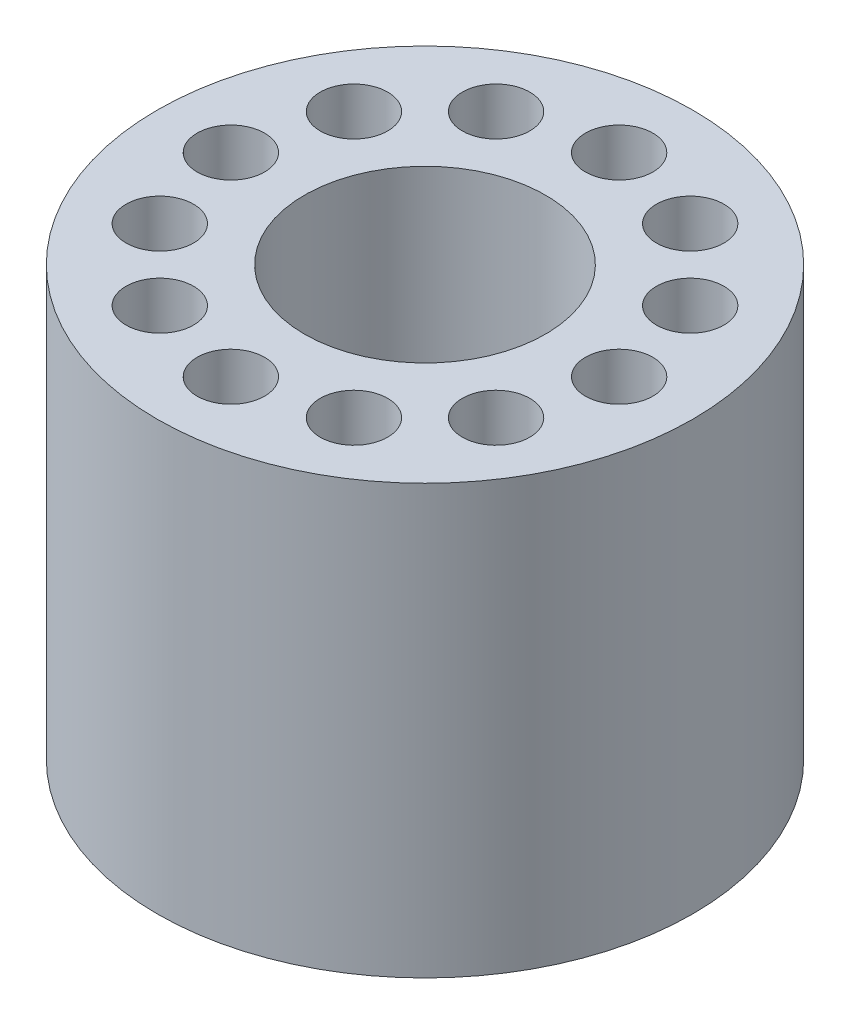
ISO-10303-21;
HEADER;
FILE_DESCRIPTION(('STEP AP214'),'2;1');
FILE_NAME('part.step','',(''),(''),'','','');
FILE_SCHEMA(('AUTOMOTIVE_DESIGN { 1 0 10303 214 1 1 1 1 }'));
ENDSEC;
DATA;
#1=APPLICATION_CONTEXT('core data for automotive mechanical design processes');
#2=APPLICATION_PROTOCOL_DEFINITION('international standard','automotive_design',2000,#1);
#3=PRODUCT_CONTEXT('',#1,'mechanical');
#4=PRODUCT('Part','Part','',(#3));
#5=PRODUCT_RELATED_PRODUCT_CATEGORY('part','',(#4));
#6=PRODUCT_DEFINITION_FORMATION('','',#4);
#7=PRODUCT_DEFINITION_CONTEXT('part definition',#1,'design');
#8=PRODUCT_DEFINITION('design','',#6,#7);
#9=PRODUCT_DEFINITION_SHAPE('','',#8);
#10=(LENGTH_UNIT() NAMED_UNIT(*) SI_UNIT(.MILLI.,.METRE.));
#11=(NAMED_UNIT(*) PLANE_ANGLE_UNIT() SI_UNIT($,.RADIAN.));
#12=(NAMED_UNIT(*) SI_UNIT($,.STERADIAN.) SOLID_ANGLE_UNIT());
#13=UNCERTAINTY_MEASURE_WITH_UNIT(LENGTH_MEASURE(1.E-05),#10,'distance_accuracy_value','');
#14=(GEOMETRIC_REPRESENTATION_CONTEXT(3) GLOBAL_UNCERTAINTY_ASSIGNED_CONTEXT((#13)) GLOBAL_UNIT_ASSIGNED_CONTEXT((#10,
#11,#12)) REPRESENTATION_CONTEXT('',''));
#15=CARTESIAN_POINT('',(0.,0.,0.));
#16=DIRECTION('',(0.,0.,1.));
#17=DIRECTION('',(1.,0.,0.));
#18=AXIS2_PLACEMENT_3D('',#15,#16,#17);
#19=CARTESIAN_POINT('',(0.,25.4,0.));
#20=DIRECTION('',(0.,1.,0.));
#21=DIRECTION('',(0.,0.,1.));
#22=AXIS2_PLACEMENT_3D('',#19,#20,#21);
#23=PLANE('',#22);
#24=CARTESIAN_POINT('',(-9.96741113168158,25.4,5.75468749999991));
#25=DIRECTION('',(0.,1.,0.));
#26=DIRECTION('',(0.,0.,1.));
#27=AXIS2_PLACEMENT_3D('',#24,#25,#26);
#28=CIRCLE('',#27,2.);
#29=CARTESIAN_POINT('',(-9.96741113168158,25.4,7.75468749999991));
#30=VERTEX_POINT('',#29);
#31=EDGE_CURVE('E93',#30,#30,#28,.T.);
#32=ORIENTED_EDGE('',*,*,#31,.F.);
#33=EDGE_LOOP('',(#32));
#34=FACE_BOUND('',#33,.T.);
#35=CARTESIAN_POINT('',(-5.75468750000008,25.4,9.96741113168147));
#36=DIRECTION('',(0.,1.,0.));
#37=DIRECTION('',(0.,0.,1.));
#38=AXIS2_PLACEMENT_3D('',#35,#36,#37);
#39=CIRCLE('',#38,2.);
#40=CARTESIAN_POINT('',(-5.75468750000008,25.4,11.9674111316815));
#41=VERTEX_POINT('',#40);
#42=EDGE_CURVE('E100',#41,#41,#39,.T.);
#43=ORIENTED_EDGE('',*,*,#42,.F.);
#44=EDGE_LOOP('',(#43));
#45=FACE_BOUND('',#44,.T.);
#46=CARTESIAN_POINT('',(0.,25.4,11.509375));
#47=DIRECTION('',(0.,1.,0.));
#48=DIRECTION('',(0.,0.,1.));
#49=AXIS2_PLACEMENT_3D('',#46,#47,#48);
#50=CIRCLE('',#49,2.);
#51=CARTESIAN_POINT('',(0.,25.4,13.509375));
#52=VERTEX_POINT('',#51);
#53=EDGE_CURVE('E106',#52,#52,#50,.T.);
#54=ORIENTED_EDGE('',*,*,#53,.F.);
#55=EDGE_LOOP('',(#54));
#56=FACE_BOUND('',#55,.T.);
#57=CARTESIAN_POINT('',(5.75468749999995,25.4,9.96741113168156));
#58=DIRECTION('',(0.,1.,0.));
#59=DIRECTION('',(0.,0.,1.));
#60=AXIS2_PLACEMENT_3D('',#57,#58,#59);
#61=CIRCLE('',#60,2.);
#62=CARTESIAN_POINT('',(5.75468749999995,25.4,11.9674111316816));
#63=VERTEX_POINT('',#62);
#64=EDGE_CURVE('E70',#63,#63,#61,.T.);
#65=ORIENTED_EDGE('',*,*,#64,.F.);
#66=EDGE_LOOP('',(#65));
#67=FACE_BOUND('',#66,.T.);
#68=CARTESIAN_POINT('',(9.9674111316815,25.4,5.75468750000005));
#69=DIRECTION('',(0.,1.,0.));
#70=DIRECTION('',(0.,0.,1.));
#71=AXIS2_PLACEMENT_3D('',#68,#69,#70);
#72=CIRCLE('',#71,2.);
#73=CARTESIAN_POINT('',(9.9674111316815,25.4,7.75468750000005));
#74=VERTEX_POINT('',#73);
#75=EDGE_CURVE('E69',#74,#74,#72,.T.);
#76=ORIENTED_EDGE('',*,*,#75,.F.);
#77=EDGE_LOOP('',(#76));
#78=FACE_BOUND('',#77,.T.);
#79=CARTESIAN_POINT('',(11.509375,25.4,0.));
#80=DIRECTION('',(0.,1.,0.));
#81=DIRECTION('',(0.,0.,1.));
#82=AXIS2_PLACEMENT_3D('',#79,#80,#81);
#83=CIRCLE('',#82,2.);
#84=CARTESIAN_POINT('',(11.509375,25.4,2.00000000000004));
#85=VERTEX_POINT('',#84);
#86=EDGE_CURVE('E76',#85,#85,#83,.T.);
#87=ORIENTED_EDGE('',*,*,#86,.F.);
#88=EDGE_LOOP('',(#87));
#89=FACE_BOUND('',#88,.T.);
#90=CARTESIAN_POINT('',(9.96741113168154,25.4,-5.75468749999998));
#91=DIRECTION('',(0.,1.,0.));
#92=DIRECTION('',(0.,0.,1.));
#93=AXIS2_PLACEMENT_3D('',#90,#91,#92);
#94=CIRCLE('',#93,2.);
#95=CARTESIAN_POINT('',(9.96741113168154,25.4,-3.75468749999998));
#96=VERTEX_POINT('',#95);
#97=EDGE_CURVE('E82',#96,#96,#94,.T.);
#98=ORIENTED_EDGE('',*,*,#97,.F.);
#99=EDGE_LOOP('',(#98));
#100=FACE_BOUND('',#99,.T.);
#101=CARTESIAN_POINT('',(5.75468750000001,25.4,-9.96741113168152));
#102=DIRECTION('',(0.,1.,0.));
#103=DIRECTION('',(0.,0.,1.));
#104=AXIS2_PLACEMENT_3D('',#101,#102,#103);
#105=CIRCLE('',#104,2.);
#106=CARTESIAN_POINT('',(5.75468750000001,25.4,-7.96741113168152));
#107=VERTEX_POINT('',#106);
#108=EDGE_CURVE('E63',#107,#107,#105,.T.);
#109=ORIENTED_EDGE('',*,*,#108,.F.);
#110=EDGE_LOOP('',(#109));
#111=FACE_BOUND('',#110,.T.);
#112=CARTESIAN_POINT('',(-11.509375,25.4,-1.20554304102743E-13));
#113=DIRECTION('',(0.,1.,0.));
#114=DIRECTION('',(0.,0.,1.));
#115=AXIS2_PLACEMENT_3D('',#112,#113,#114);
#116=CIRCLE('',#115,2.);
#117=CARTESIAN_POINT('',(-11.509375,25.4,1.99999999999988));
#118=VERTEX_POINT('',#117);
#119=EDGE_CURVE('E94',#118,#118,#116,.T.);
#120=ORIENTED_EDGE('',*,*,#119,.F.);
#121=EDGE_LOOP('',(#120));
#122=FACE_BOUND('',#121,.T.);
#123=CARTESIAN_POINT('',(-9.96741113168146,25.4,-5.75468750000012));
#124=DIRECTION('',(0.,1.,0.));
#125=DIRECTION('',(0.,0.,1.));
#126=AXIS2_PLACEMENT_3D('',#123,#124,#125);
#127=CIRCLE('',#126,2.);
#128=CARTESIAN_POINT('',(-9.96741113168146,25.4,-3.75468750000012));
#129=VERTEX_POINT('',#128);
#130=EDGE_CURVE('E123',#129,#129,#127,.T.);
#131=ORIENTED_EDGE('',*,*,#130,.F.);
#132=EDGE_LOOP('',(#131));
#133=FACE_BOUND('',#132,.T.);
#134=CARTESIAN_POINT('',(-5.75468749999987,25.4,-9.9674111316816));
#135=DIRECTION('',(0.,1.,0.));
#136=DIRECTION('',(0.,0.,1.));
#137=AXIS2_PLACEMENT_3D('',#134,#135,#136);
#138=CIRCLE('',#137,2.);
#139=CARTESIAN_POINT('',(-5.75468749999987,25.4,-7.9674111316816));
#140=VERTEX_POINT('',#139);
#141=EDGE_CURVE('E117',#140,#140,#138,.T.);
#142=ORIENTED_EDGE('',*,*,#141,.F.);
#143=EDGE_LOOP('',(#142));
#144=FACE_BOUND('',#143,.T.);
#145=CARTESIAN_POINT('',(0.,25.4,-11.509375));
#146=DIRECTION('',(0.,1.,0.));
#147=DIRECTION('',(0.,0.,1.));
#148=AXIS2_PLACEMENT_3D('',#145,#146,#147);
#149=CIRCLE('',#148,2.);
#150=CARTESIAN_POINT('',(0.,25.4,-9.509375));
#151=VERTEX_POINT('',#150);
#152=EDGE_CURVE('E60',#151,#151,#149,.T.);
#153=ORIENTED_EDGE('',*,*,#152,.F.);
#154=EDGE_LOOP('',(#153));
#155=FACE_BOUND('',#154,.T.);
#156=CARTESIAN_POINT('',(0.,25.4,0.));
#157=DIRECTION('',(0.,1.,0.));
#158=DIRECTION('',(0.,0.,1.));
#159=AXIS2_PLACEMENT_3D('',#156,#157,#158);
#160=CIRCLE('',#159,15.875);
#161=CARTESIAN_POINT('',(0.,25.4,15.875));
#162=VERTEX_POINT('',#161);
#163=EDGE_CURVE('E10',#162,#162,#160,.T.);
#164=ORIENTED_EDGE('',*,*,#163,.T.);
#165=EDGE_LOOP('',(#164));
#166=FACE_BOUND('',#165,.T.);
#167=CARTESIAN_POINT('',(0.,25.4,0.));
#168=DIRECTION('',(0.,1.,0.));
#169=DIRECTION('',(0.,0.,1.));
#170=AXIS2_PLACEMENT_3D('',#167,#168,#169);
#171=CIRCLE('',#170,7.14375);
#172=CARTESIAN_POINT('',(0.,25.4,7.14375));
#173=VERTEX_POINT('',#172);
#174=EDGE_CURVE('E52',#173,#173,#171,.T.);
#175=ORIENTED_EDGE('',*,*,#174,.F.);
#176=EDGE_LOOP('',(#175));
#177=FACE_BOUND('',#176,.T.);
#178=ADVANCED_FACE('F41',(#34,#45,#56,#67,#78,#89,#100,#111,#122,#133,#144,#155,#166,#177),#23,.T.);
#179=CARTESIAN_POINT('',(0.,0.,0.));
#180=DIRECTION('',(0.,1.,0.));
#181=DIRECTION('',(0.,0.,1.));
#182=AXIS2_PLACEMENT_3D('',#179,#180,#181);
#183=PLANE('',#182);
#184=CARTESIAN_POINT('',(-9.96741113168158,0.,5.75468749999991));
#185=DIRECTION('',(0.,1.,0.));
#186=DIRECTION('',(0.,0.,1.));
#187=AXIS2_PLACEMENT_3D('',#184,#185,#186);
#188=CIRCLE('',#187,2.);
#189=CARTESIAN_POINT('',(-9.96741113168158,0.,7.75468749999991));
#190=VERTEX_POINT('',#189);
#191=EDGE_CURVE('E90',#190,#190,#188,.T.);
#192=ORIENTED_EDGE('',*,*,#191,.T.);
#193=EDGE_LOOP('',(#192));
#194=FACE_BOUND('',#193,.T.);
#195=CARTESIAN_POINT('',(-5.75468750000008,0.,9.96741113168147));
#196=DIRECTION('',(0.,1.,0.));
#197=DIRECTION('',(0.,0.,1.));
#198=AXIS2_PLACEMENT_3D('',#195,#196,#197);
#199=CIRCLE('',#198,2.);
#200=CARTESIAN_POINT('',(-5.75468750000008,0.,11.9674111316815));
#201=VERTEX_POINT('',#200);
#202=EDGE_CURVE('E97',#201,#201,#199,.T.);
#203=ORIENTED_EDGE('',*,*,#202,.T.);
#204=EDGE_LOOP('',(#203));
#205=FACE_BOUND('',#204,.T.);
#206=CARTESIAN_POINT('',(0.,0.,11.509375));
#207=DIRECTION('',(0.,1.,0.));
#208=DIRECTION('',(0.,0.,1.));
#209=AXIS2_PLACEMENT_3D('',#206,#207,#208);
#210=CIRCLE('',#209,2.);
#211=CARTESIAN_POINT('',(0.,0.,13.509375));
#212=VERTEX_POINT('',#211);
#213=EDGE_CURVE('E103',#212,#212,#210,.T.);
#214=ORIENTED_EDGE('',*,*,#213,.T.);
#215=EDGE_LOOP('',(#214));
#216=FACE_BOUND('',#215,.T.);
#217=CARTESIAN_POINT('',(5.75468749999995,0.,9.96741113168156));
#218=DIRECTION('',(0.,1.,0.));
#219=DIRECTION('',(0.,0.,1.));
#220=AXIS2_PLACEMENT_3D('',#217,#218,#219);
#221=CIRCLE('',#220,2.);
#222=CARTESIAN_POINT('',(5.75468749999995,0.,11.9674111316816));
#223=VERTEX_POINT('',#222);
#224=EDGE_CURVE('E109',#223,#223,#221,.T.);
#225=ORIENTED_EDGE('',*,*,#224,.T.);
#226=EDGE_LOOP('',(#225));
#227=FACE_BOUND('',#226,.T.);
#228=CARTESIAN_POINT('',(9.9674111316815,0.,5.75468750000005));
#229=DIRECTION('',(0.,1.,0.));
#230=DIRECTION('',(0.,0.,1.));
#231=AXIS2_PLACEMENT_3D('',#228,#229,#230);
#232=CIRCLE('',#231,2.);
#233=CARTESIAN_POINT('',(9.9674111316815,0.,7.75468750000005));
#234=VERTEX_POINT('',#233);
#235=EDGE_CURVE('E66',#234,#234,#232,.T.);
#236=ORIENTED_EDGE('',*,*,#235,.T.);
#237=EDGE_LOOP('',(#236));
#238=FACE_BOUND('',#237,.T.);
#239=CARTESIAN_POINT('',(11.509375,0.,0.));
#240=DIRECTION('',(0.,1.,0.));
#241=DIRECTION('',(0.,0.,1.));
#242=AXIS2_PLACEMENT_3D('',#239,#240,#241);
#243=CIRCLE('',#242,2.);
#244=CARTESIAN_POINT('',(11.509375,0.,2.00000000000004));
#245=VERTEX_POINT('',#244);
#246=EDGE_CURVE('E73',#245,#245,#243,.T.);
#247=ORIENTED_EDGE('',*,*,#246,.T.);
#248=EDGE_LOOP('',(#247));
#249=FACE_BOUND('',#248,.T.);
#250=CARTESIAN_POINT('',(9.96741113168154,0.,-5.75468749999998));
#251=DIRECTION('',(0.,1.,0.));
#252=DIRECTION('',(0.,0.,1.));
#253=AXIS2_PLACEMENT_3D('',#250,#251,#252);
#254=CIRCLE('',#253,2.);
#255=CARTESIAN_POINT('',(9.96741113168154,0.,-3.75468749999998));
#256=VERTEX_POINT('',#255);
#257=EDGE_CURVE('E79',#256,#256,#254,.T.);
#258=ORIENTED_EDGE('',*,*,#257,.T.);
#259=EDGE_LOOP('',(#258));
#260=FACE_BOUND('',#259,.T.);
#261=CARTESIAN_POINT('',(5.75468750000001,0.,-9.96741113168152));
#262=DIRECTION('',(0.,1.,0.));
#263=DIRECTION('',(0.,0.,1.));
#264=AXIS2_PLACEMENT_3D('',#261,#262,#263);
#265=CIRCLE('',#264,2.);
#266=CARTESIAN_POINT('',(5.75468750000001,0.,-7.96741113168152));
#267=VERTEX_POINT('',#266);
#268=EDGE_CURVE('E85',#267,#267,#265,.T.);
#269=ORIENTED_EDGE('',*,*,#268,.T.);
#270=EDGE_LOOP('',(#269));
#271=FACE_BOUND('',#270,.T.);
#272=CARTESIAN_POINT('',(-11.509375,0.,-1.20554304102743E-13));
#273=DIRECTION('',(0.,1.,0.));
#274=DIRECTION('',(0.,0.,1.));
#275=AXIS2_PLACEMENT_3D('',#272,#273,#274);
#276=CIRCLE('',#275,2.);
#277=CARTESIAN_POINT('',(-11.509375,0.,1.99999999999988));
#278=VERTEX_POINT('',#277);
#279=EDGE_CURVE('E126',#278,#278,#276,.T.);
#280=ORIENTED_EDGE('',*,*,#279,.T.);
#281=EDGE_LOOP('',(#280));
#282=FACE_BOUND('',#281,.T.);
#283=CARTESIAN_POINT('',(-9.96741113168146,0.,-5.75468750000012));
#284=DIRECTION('',(0.,1.,0.));
#285=DIRECTION('',(0.,0.,1.));
#286=AXIS2_PLACEMENT_3D('',#283,#284,#285);
#287=CIRCLE('',#286,2.);
#288=CARTESIAN_POINT('',(-9.96741113168146,0.,-3.75468750000012));
#289=VERTEX_POINT('',#288);
#290=EDGE_CURVE('E120',#289,#289,#287,.T.);
#291=ORIENTED_EDGE('',*,*,#290,.T.);
#292=EDGE_LOOP('',(#291));
#293=FACE_BOUND('',#292,.T.);
#294=CARTESIAN_POINT('',(-5.75468749999987,0.,-9.9674111316816));
#295=DIRECTION('',(0.,1.,0.));
#296=DIRECTION('',(0.,0.,1.));
#297=AXIS2_PLACEMENT_3D('',#294,#295,#296);
#298=CIRCLE('',#297,2.);
#299=CARTESIAN_POINT('',(-5.75468749999987,0.,-7.9674111316816));
#300=VERTEX_POINT('',#299);
#301=EDGE_CURVE('E114',#300,#300,#298,.T.);
#302=ORIENTED_EDGE('',*,*,#301,.T.);
#303=EDGE_LOOP('',(#302));
#304=FACE_BOUND('',#303,.T.);
#305=CARTESIAN_POINT('',(0.,0.,-11.509375));
#306=DIRECTION('',(0.,1.,0.));
#307=DIRECTION('',(0.,0.,1.));
#308=AXIS2_PLACEMENT_3D('',#305,#306,#307);
#309=CIRCLE('',#308,2.);
#310=CARTESIAN_POINT('',(0.,0.,-9.509375));
#311=VERTEX_POINT('',#310);
#312=EDGE_CURVE('E57',#311,#311,#309,.T.);
#313=ORIENTED_EDGE('',*,*,#312,.T.);
#314=EDGE_LOOP('',(#313));
#315=FACE_BOUND('',#314,.T.);
#316=CARTESIAN_POINT('',(0.,0.,0.));
#317=DIRECTION('',(0.,1.,0.));
#318=DIRECTION('',(0.,0.,1.));
#319=AXIS2_PLACEMENT_3D('',#316,#317,#318);
#320=CIRCLE('',#319,15.875);
#321=CARTESIAN_POINT('',(0.,0.,15.875));
#322=VERTEX_POINT('',#321);
#323=EDGE_CURVE('E45',#322,#322,#320,.T.);
#324=ORIENTED_EDGE('',*,*,#323,.F.);
#325=EDGE_LOOP('',(#324));
#326=FACE_BOUND('',#325,.T.);
#327=CARTESIAN_POINT('',(0.,0.,0.));
#328=DIRECTION('',(0.,1.,0.));
#329=DIRECTION('',(0.,0.,1.));
#330=AXIS2_PLACEMENT_3D('',#327,#328,#329);
#331=CIRCLE('',#330,7.14375);
#332=CARTESIAN_POINT('',(0.,0.,7.14375));
#333=VERTEX_POINT('',#332);
#334=EDGE_CURVE('E54',#333,#333,#331,.T.);
#335=ORIENTED_EDGE('',*,*,#334,.T.);
#336=EDGE_LOOP('',(#335));
#337=FACE_BOUND('',#336,.T.);
#338=ADVANCED_FACE('F136',(#194,#205,#216,#227,#238,#249,#260,#271,#282,#293,#304,#315,#326,
#337),#183,.F.);
#339=CARTESIAN_POINT('',(0.,25.4,0.));
#340=DIRECTION('',(0.,-1.,0.));
#341=DIRECTION('',(0.,0.,-1.));
#342=AXIS2_PLACEMENT_3D('',#339,#340,#341);
#343=CYLINDRICAL_SURFACE('',#342,15.875);
#344=ORIENTED_EDGE('',*,*,#163,.F.);
#345=EDGE_LOOP('',(#344));
#346=FACE_BOUND('',#345,.T.);
#347=ORIENTED_EDGE('',*,*,#323,.T.);
#348=EDGE_LOOP('',(#347));
#349=FACE_BOUND('',#348,.T.);
#350=ADVANCED_FACE('F43',(#346,#349),#343,.T.);
#351=CARTESIAN_POINT('',(0.,25.4,0.));
#352=DIRECTION('',(0.,-1.,0.));
#353=DIRECTION('',(0.,0.,-1.));
#354=AXIS2_PLACEMENT_3D('',#351,#352,#353);
#355=CYLINDRICAL_SURFACE('',#354,7.14375);
#356=ORIENTED_EDGE('',*,*,#174,.T.);
#357=EDGE_LOOP('',(#356));
#358=FACE_BOUND('',#357,.T.);
#359=ORIENTED_EDGE('',*,*,#334,.F.);
#360=EDGE_LOOP('',(#359));
#361=FACE_BOUND('',#360,.T.);
#362=ADVANCED_FACE('F147',(#358,#361),#355,.F.);
#363=CARTESIAN_POINT('',(0.,0.,-11.509375));
#364=DIRECTION('',(0.,1.,0.));
#365=DIRECTION('',(0.,0.,1.));
#366=AXIS2_PLACEMENT_3D('',#363,#364,#365);
#367=CYLINDRICAL_SURFACE('',#366,2.);
#368=ORIENTED_EDGE('',*,*,#312,.F.);
#369=EDGE_LOOP('',(#368));
#370=FACE_BOUND('',#369,.T.);
#371=ORIENTED_EDGE('',*,*,#152,.T.);
#372=EDGE_LOOP('',(#371));
#373=FACE_BOUND('',#372,.T.);
#374=ADVANCED_FACE('F150',(#370,#373),#367,.F.);
#375=CARTESIAN_POINT('',(-5.75468749999987,0.,-9.9674111316816));
#376=DIRECTION('',(0.,1.,0.));
#377=DIRECTION('',(0.,0.,1.));
#378=AXIS2_PLACEMENT_3D('',#375,#376,#377);
#379=CYLINDRICAL_SURFACE('',#378,2.);
#380=ORIENTED_EDGE('',*,*,#301,.F.);
#381=EDGE_LOOP('',(#380));
#382=FACE_BOUND('',#381,.T.);
#383=ORIENTED_EDGE('',*,*,#141,.T.);
#384=EDGE_LOOP('',(#383));
#385=FACE_BOUND('',#384,.T.);
#386=ADVANCED_FACE('F164',(#382,#385),#379,.F.);
#387=CARTESIAN_POINT('',(-9.96741113168146,0.,-5.75468750000012));
#388=DIRECTION('',(0.,1.,0.));
#389=DIRECTION('',(0.,0.,1.));
#390=AXIS2_PLACEMENT_3D('',#387,#388,#389);
#391=CYLINDRICAL_SURFACE('',#390,2.);
#392=ORIENTED_EDGE('',*,*,#290,.F.);
#393=EDGE_LOOP('',(#392));
#394=FACE_BOUND('',#393,.T.);
#395=ORIENTED_EDGE('',*,*,#130,.T.);
#396=EDGE_LOOP('',(#395));
#397=FACE_BOUND('',#396,.T.);
#398=ADVANCED_FACE('F200',(#394,#397),#391,.F.);
#399=CARTESIAN_POINT('',(-11.509375,0.,-1.20554304102743E-13));
#400=DIRECTION('',(0.,1.,0.));
#401=DIRECTION('',(0.,0.,1.));
#402=AXIS2_PLACEMENT_3D('',#399,#400,#401);
#403=CYLINDRICAL_SURFACE('',#402,2.);
#404=ORIENTED_EDGE('',*,*,#279,.F.);
#405=EDGE_LOOP('',(#404));
#406=FACE_BOUND('',#405,.T.);
#407=ORIENTED_EDGE('',*,*,#119,.T.);
#408=EDGE_LOOP('',(#407));
#409=FACE_BOUND('',#408,.T.);
#410=ADVANCED_FACE('F132',(#406,#409),#403,.F.);
#411=CARTESIAN_POINT('',(5.75468750000001,0.,-9.96741113168152));
#412=DIRECTION('',(0.,1.,0.));
#413=DIRECTION('',(0.,0.,1.));
#414=AXIS2_PLACEMENT_3D('',#411,#412,#413);
#415=CYLINDRICAL_SURFACE('',#414,2.);
#416=ORIENTED_EDGE('',*,*,#268,.F.);
#417=EDGE_LOOP('',(#416));
#418=FACE_BOUND('',#417,.T.);
#419=ORIENTED_EDGE('',*,*,#108,.T.);
#420=EDGE_LOOP('',(#419));
#421=FACE_BOUND('',#420,.T.);
#422=ADVANCED_FACE('F178',(#418,#421),#415,.F.);
#423=CARTESIAN_POINT('',(9.96741113168154,0.,-5.75468749999998));
#424=DIRECTION('',(0.,1.,0.));
#425=DIRECTION('',(0.,0.,1.));
#426=AXIS2_PLACEMENT_3D('',#423,#424,#425);
#427=CYLINDRICAL_SURFACE('',#426,2.);
#428=ORIENTED_EDGE('',*,*,#257,.F.);
#429=EDGE_LOOP('',(#428));
#430=FACE_BOUND('',#429,.T.);
#431=ORIENTED_EDGE('',*,*,#97,.T.);
#432=EDGE_LOOP('',(#431));
#433=FACE_BOUND('',#432,.T.);
#434=ADVANCED_FACE('F174',(#430,#433),#427,.F.);
#435=CARTESIAN_POINT('',(11.509375,0.,0.));
#436=DIRECTION('',(0.,1.,0.));
#437=DIRECTION('',(0.,0.,1.));
#438=AXIS2_PLACEMENT_3D('',#435,#436,#437);
#439=CYLINDRICAL_SURFACE('',#438,2.);
#440=ORIENTED_EDGE('',*,*,#246,.F.);
#441=EDGE_LOOP('',(#440));
#442=FACE_BOUND('',#441,.T.);
#443=ORIENTED_EDGE('',*,*,#86,.T.);
#444=EDGE_LOOP('',(#443));
#445=FACE_BOUND('',#444,.T.);
#446=ADVANCED_FACE('F170',(#442,#445),#439,.F.);
#447=CARTESIAN_POINT('',(9.9674111316815,0.,5.75468750000005));
#448=DIRECTION('',(0.,1.,0.));
#449=DIRECTION('',(0.,0.,1.));
#450=AXIS2_PLACEMENT_3D('',#447,#448,#449);
#451=CYLINDRICAL_SURFACE('',#450,2.);
#452=ORIENTED_EDGE('',*,*,#235,.F.);
#453=EDGE_LOOP('',(#452));
#454=FACE_BOUND('',#453,.T.);
#455=ORIENTED_EDGE('',*,*,#75,.T.);
#456=EDGE_LOOP('',(#455));
#457=FACE_BOUND('',#456,.T.);
#458=ADVANCED_FACE('F166',(#454,#457),#451,.F.);
#459=CARTESIAN_POINT('',(5.75468749999995,0.,9.96741113168156));
#460=DIRECTION('',(0.,1.,0.));
#461=DIRECTION('',(0.,0.,1.));
#462=AXIS2_PLACEMENT_3D('',#459,#460,#461);
#463=CYLINDRICAL_SURFACE('',#462,2.);
#464=ORIENTED_EDGE('',*,*,#224,.F.);
#465=EDGE_LOOP('',(#464));
#466=FACE_BOUND('',#465,.T.);
#467=ORIENTED_EDGE('',*,*,#64,.T.);
#468=EDGE_LOOP('',(#467));
#469=FACE_BOUND('',#468,.T.);
#470=ADVANCED_FACE('F169',(#466,#469),#463,.F.);
#471=CARTESIAN_POINT('',(0.,0.,11.509375));
#472=DIRECTION('',(0.,1.,0.));
#473=DIRECTION('',(0.,0.,1.));
#474=AXIS2_PLACEMENT_3D('',#471,#472,#473);
#475=CYLINDRICAL_SURFACE('',#474,2.);
#476=ORIENTED_EDGE('',*,*,#213,.F.);
#477=EDGE_LOOP('',(#476));
#478=FACE_BOUND('',#477,.T.);
#479=ORIENTED_EDGE('',*,*,#53,.T.);
#480=EDGE_LOOP('',(#479));
#481=FACE_BOUND('',#480,.T.);
#482=ADVANCED_FACE('F190',(#478,#481),#475,.F.);
#483=CARTESIAN_POINT('',(-5.75468750000008,0.,9.96741113168147));
#484=DIRECTION('',(0.,1.,0.));
#485=DIRECTION('',(0.,0.,1.));
#486=AXIS2_PLACEMENT_3D('',#483,#484,#485);
#487=CYLINDRICAL_SURFACE('',#486,2.);
#488=ORIENTED_EDGE('',*,*,#202,.F.);
#489=EDGE_LOOP('',(#488));
#490=FACE_BOUND('',#489,.T.);
#491=ORIENTED_EDGE('',*,*,#42,.T.);
#492=EDGE_LOOP('',(#491));
#493=FACE_BOUND('',#492,.T.);
#494=ADVANCED_FACE('F186',(#490,#493),#487,.F.);
#495=CARTESIAN_POINT('',(-9.96741113168158,0.,5.75468749999991));
#496=DIRECTION('',(0.,1.,0.));
#497=DIRECTION('',(0.,0.,1.));
#498=AXIS2_PLACEMENT_3D('',#495,#496,#497);
#499=CYLINDRICAL_SURFACE('',#498,2.);
#500=ORIENTED_EDGE('',*,*,#191,.F.);
#501=EDGE_LOOP('',(#500));
#502=FACE_BOUND('',#501,.T.);
#503=ORIENTED_EDGE('',*,*,#31,.T.);
#504=EDGE_LOOP('',(#503));
#505=FACE_BOUND('',#504,.T.);
#506=ADVANCED_FACE('F183',(#502,#505),#499,.F.);
#507=CLOSED_SHELL('',(#178,#338,#350,#362,#374,#386,#398,#410,#422,#434,#446,#458,#470,#482,
#494,#506));
#508=MANIFOLD_SOLID_BREP('B2',#507);
#509=ADVANCED_BREP_SHAPE_REPRESENTATION('',(#18,#508),#14);
#510=SHAPE_DEFINITION_REPRESENTATION(#9,#509);
ENDSEC;
END-ISO-10303-21;
